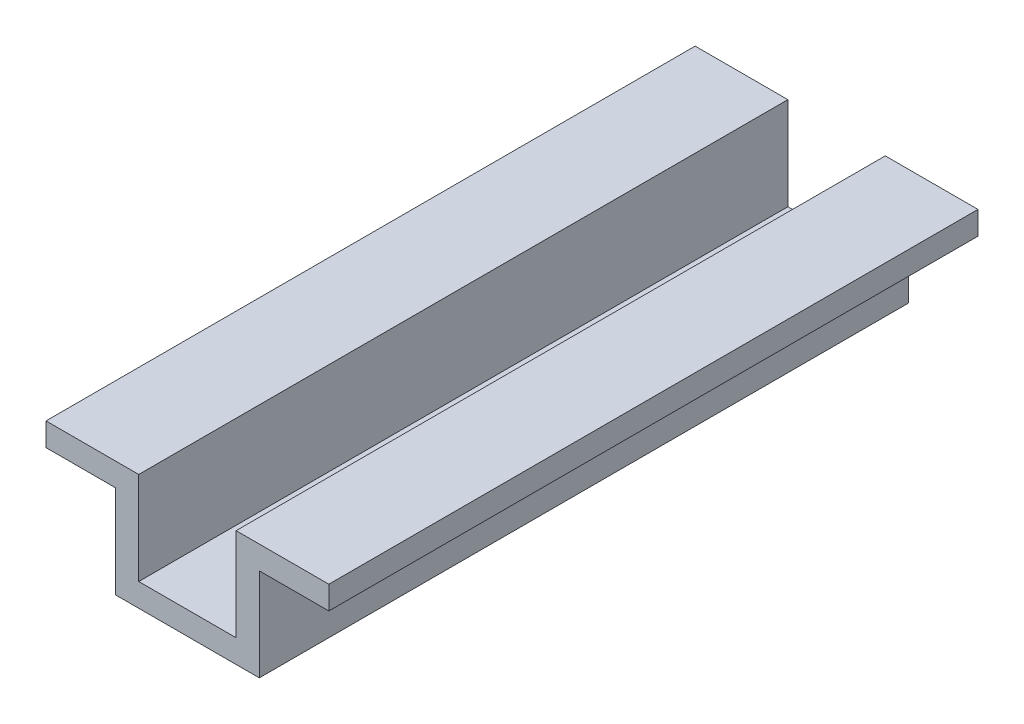
ISO-10303-21;
HEADER;
FILE_DESCRIPTION(('STEP AP214'),'2;1');
FILE_NAME('part.step','',(''),(''),'','','');
FILE_SCHEMA(('AUTOMOTIVE_DESIGN { 1 0 10303 214 1 1 1 1 }'));
ENDSEC;
DATA;
#1=APPLICATION_CONTEXT('core data for automotive mechanical design processes');
#2=APPLICATION_PROTOCOL_DEFINITION('international standard','automotive_design',2000,#1);
#3=PRODUCT_CONTEXT('',#1,'mechanical');
#4=PRODUCT('Part','Part','',(#3));
#5=PRODUCT_RELATED_PRODUCT_CATEGORY('part','',(#4));
#6=PRODUCT_DEFINITION_FORMATION('','',#4);
#7=PRODUCT_DEFINITION_CONTEXT('part definition',#1,'design');
#8=PRODUCT_DEFINITION('design','',#6,#7);
#9=PRODUCT_DEFINITION_SHAPE('','',#8);
#10=(LENGTH_UNIT() NAMED_UNIT(*) SI_UNIT(.MILLI.,.METRE.));
#11=(NAMED_UNIT(*) PLANE_ANGLE_UNIT() SI_UNIT($,.RADIAN.));
#12=(NAMED_UNIT(*) SI_UNIT($,.STERADIAN.) SOLID_ANGLE_UNIT());
#13=UNCERTAINTY_MEASURE_WITH_UNIT(LENGTH_MEASURE(1.E-05),#10,'distance_accuracy_value','');
#14=(GEOMETRIC_REPRESENTATION_CONTEXT(3) GLOBAL_UNCERTAINTY_ASSIGNED_CONTEXT((#13)) GLOBAL_UNIT_ASSIGNED_CONTEXT((#10,
#11,#12)) REPRESENTATION_CONTEXT('',''));
#15=CARTESIAN_POINT('',(0.,0.,0.));
#16=DIRECTION('',(0.,0.,1.));
#17=DIRECTION('',(1.,0.,0.));
#18=AXIS2_PLACEMENT_3D('',#15,#16,#17);
#19=CARTESIAN_POINT('',(0.,20.,140.));
#20=DIRECTION('',(0.,-1.,0.));
#21=DIRECTION('',(0.,0.,-1.));
#22=AXIS2_PLACEMENT_3D('',#19,#20,#21);
#23=PLANE('',#22);
#24=DIRECTION('',(-1.,0.,0.));
#25=VECTOR('',#24,1.);
#26=CARTESIAN_POINT('',(0.,20.,0.));
#27=LINE('',#26,#25);
#28=CARTESIAN_POINT('',(0.,20.,0.));
#29=VERTEX_POINT('',#28);
#30=CARTESIAN_POINT('',(-20.,20.,0.));
#31=VERTEX_POINT('',#30);
#32=EDGE_CURVE('E153',#29,#31,#27,.T.);
#33=ORIENTED_EDGE('',*,*,#32,.T.);
#34=DIRECTION('',(0.,0.,-1.));
#35=VECTOR('',#34,1.);
#36=CARTESIAN_POINT('',(-20.,20.,140.));
#37=LINE('',#36,#35);
#38=CARTESIAN_POINT('',(-20.,20.,140.));
#39=VERTEX_POINT('',#38);
#40=EDGE_CURVE('E11',#39,#31,#37,.T.);
#41=ORIENTED_EDGE('',*,*,#40,.F.);
#42=DIRECTION('',(-1.,0.,0.));
#43=VECTOR('',#42,1.);
#44=CARTESIAN_POINT('',(0.,20.,140.));
#45=LINE('',#44,#43);
#46=CARTESIAN_POINT('',(0.,20.,140.));
#47=VERTEX_POINT('',#46);
#48=EDGE_CURVE('E101',#47,#39,#45,.T.);
#49=ORIENTED_EDGE('',*,*,#48,.F.);
#50=DIRECTION('',(0.,0.,-1.));
#51=VECTOR('',#50,1.);
#52=CARTESIAN_POINT('',(0.,20.,140.));
#53=LINE('',#52,#51);
#54=EDGE_CURVE('E149',#47,#29,#53,.T.);
#55=ORIENTED_EDGE('',*,*,#54,.T.);
#56=EDGE_LOOP('',(#33,#41,#49,#55));
#57=FACE_BOUND('',#56,.T.);
#58=ADVANCED_FACE('F33',(#57),#23,.F.);
#59=CARTESIAN_POINT('',(-20.,15.,140.));
#60=DIRECTION('',(-1.,0.,0.));
#61=DIRECTION('',(0.,0.,1.));
#62=AXIS2_PLACEMENT_3D('',#59,#60,#61);
#63=PLANE('',#62);
#64=DIRECTION('',(0.,1.,0.));
#65=VECTOR('',#64,1.);
#66=CARTESIAN_POINT('',(-20.,15.,0.));
#67=LINE('',#66,#65);
#68=CARTESIAN_POINT('',(-20.,15.,0.));
#69=VERTEX_POINT('',#68);
#70=EDGE_CURVE('E156',#69,#31,#67,.T.);
#71=ORIENTED_EDGE('',*,*,#70,.F.);
#72=DIRECTION('',(0.,0.,-1.));
#73=VECTOR('',#72,1.);
#74=CARTESIAN_POINT('',(-20.,15.,140.));
#75=LINE('',#74,#73);
#76=CARTESIAN_POINT('',(-20.,15.,140.));
#77=VERTEX_POINT('',#76);
#78=EDGE_CURVE('E41',#77,#69,#75,.T.);
#79=ORIENTED_EDGE('',*,*,#78,.F.);
#80=DIRECTION('',(0.,1.,0.));
#81=VECTOR('',#80,1.);
#82=CARTESIAN_POINT('',(-20.,15.,140.));
#83=LINE('',#82,#81);
#84=EDGE_CURVE('E218',#77,#39,#83,.T.);
#85=ORIENTED_EDGE('',*,*,#84,.T.);
#86=ORIENTED_EDGE('',*,*,#40,.T.);
#87=EDGE_LOOP('',(#71,#79,#85,#86));
#88=FACE_BOUND('',#87,.T.);
#89=ADVANCED_FACE('F205',(#88),#63,.T.);
#90=CARTESIAN_POINT('',(0.,15.,140.));
#91=DIRECTION('',(0.,-1.,0.));
#92=DIRECTION('',(0.,0.,-1.));
#93=AXIS2_PLACEMENT_3D('',#90,#91,#92);
#94=PLANE('',#93);
#95=DIRECTION('',(1.,0.,0.));
#96=VECTOR('',#95,1.);
#97=CARTESIAN_POINT('',(0.,15.,0.));
#98=LINE('',#97,#96);
#99=CARTESIAN_POINT('',(-5.,15.,0.));
#100=VERTEX_POINT('',#99);
#101=EDGE_CURVE('E159',#100,#69,#98,.F.);
#102=ORIENTED_EDGE('',*,*,#101,.F.);
#103=DIRECTION('',(0.,0.,-1.));
#104=VECTOR('',#103,1.);
#105=CARTESIAN_POINT('',(-5.,15.,140.));
#106=LINE('',#105,#104);
#107=CARTESIAN_POINT('',(-5.,15.,140.));
#108=VERTEX_POINT('',#107);
#109=EDGE_CURVE('E195',#108,#100,#106,.T.);
#110=ORIENTED_EDGE('',*,*,#109,.F.);
#111=DIRECTION('',(1.,0.,0.));
#112=VECTOR('',#111,1.);
#113=CARTESIAN_POINT('',(0.,15.,140.));
#114=LINE('',#113,#112);
#115=EDGE_CURVE('E202',#108,#77,#114,.F.);
#116=ORIENTED_EDGE('',*,*,#115,.T.);
#117=ORIENTED_EDGE('',*,*,#78,.T.);
#118=EDGE_LOOP('',(#102,#110,#116,#117));
#119=FACE_BOUND('',#118,.T.);
#120=ADVANCED_FACE('F200',(#119),#94,.T.);
#121=CARTESIAN_POINT('',(-5.,0.,140.));
#122=DIRECTION('',(-1.,0.,0.));
#123=DIRECTION('',(0.,0.,1.));
#124=AXIS2_PLACEMENT_3D('',#121,#122,#123);
#125=PLANE('',#124);
#126=DIRECTION('',(0.,1.,0.));
#127=VECTOR('',#126,1.);
#128=CARTESIAN_POINT('',(-5.,0.,0.));
#129=LINE('',#128,#127);
#130=CARTESIAN_POINT('',(-5.,-5.,0.));
#131=VERTEX_POINT('',#130);
#132=EDGE_CURVE('E162',#131,#100,#129,.T.);
#133=ORIENTED_EDGE('',*,*,#132,.F.);
#134=DIRECTION('',(0.,0.,-1.));
#135=VECTOR('',#134,1.);
#136=CARTESIAN_POINT('',(-5.,-5.,140.));
#137=LINE('',#136,#135);
#138=CARTESIAN_POINT('',(-5.,-5.,140.));
#139=VERTEX_POINT('',#138);
#140=EDGE_CURVE('E193',#139,#131,#137,.T.);
#141=ORIENTED_EDGE('',*,*,#140,.F.);
#142=DIRECTION('',(0.,1.,0.));
#143=VECTOR('',#142,1.);
#144=CARTESIAN_POINT('',(-5.,0.,140.));
#145=LINE('',#144,#143);
#146=EDGE_CURVE('E215',#139,#108,#145,.T.);
#147=ORIENTED_EDGE('',*,*,#146,.T.);
#148=ORIENTED_EDGE('',*,*,#109,.T.);
#149=EDGE_LOOP('',(#133,#141,#147,#148));
#150=FACE_BOUND('',#149,.T.);
#151=ADVANCED_FACE('F212',(#150),#125,.T.);
#152=CARTESIAN_POINT('',(0.,-5.,140.));
#153=DIRECTION('',(0.,-1.,0.));
#154=DIRECTION('',(0.,0.,-1.));
#155=AXIS2_PLACEMENT_3D('',#152,#153,#154);
#156=PLANE('',#155);
#157=DIRECTION('',(1.,0.,0.));
#158=VECTOR('',#157,1.);
#159=CARTESIAN_POINT('',(0.,-5.,0.));
#160=LINE('',#159,#158);
#161=CARTESIAN_POINT('',(26.,-5.,0.));
#162=VERTEX_POINT('',#161);
#163=EDGE_CURVE('E165',#162,#131,#160,.F.);
#164=ORIENTED_EDGE('',*,*,#163,.F.);
#165=DIRECTION('',(0.,0.,-1.));
#166=VECTOR('',#165,1.);
#167=CARTESIAN_POINT('',(26.,-5.,140.));
#168=LINE('',#167,#166);
#169=CARTESIAN_POINT('',(26.,-5.,140.));
#170=VERTEX_POINT('',#169);
#171=EDGE_CURVE('E191',#170,#162,#168,.T.);
#172=ORIENTED_EDGE('',*,*,#171,.F.);
#173=DIRECTION('',(1.,0.,0.));
#174=VECTOR('',#173,1.);
#175=CARTESIAN_POINT('',(0.,-5.,140.));
#176=LINE('',#175,#174);
#177=EDGE_CURVE('E220',#170,#139,#176,.F.);
#178=ORIENTED_EDGE('',*,*,#177,.T.);
#179=ORIENTED_EDGE('',*,*,#140,.T.);
#180=EDGE_LOOP('',(#164,#172,#178,#179));
#181=FACE_BOUND('',#180,.T.);
#182=ADVANCED_FACE('F320',(#181),#156,.T.);
#183=CARTESIAN_POINT('',(26.,0.,140.));
#184=DIRECTION('',(1.,0.,0.));
#185=DIRECTION('',(0.,1.,0.));
#186=AXIS2_PLACEMENT_3D('',#183,#184,#185);
#187=PLANE('',#186);
#188=DIRECTION('',(0.,-1.,0.));
#189=VECTOR('',#188,1.);
#190=CARTESIAN_POINT('',(26.,0.,0.));
#191=LINE('',#190,#189);
#192=CARTESIAN_POINT('',(26.,15.,0.));
#193=VERTEX_POINT('',#192);
#194=EDGE_CURVE('E168',#193,#162,#191,.T.);
#195=ORIENTED_EDGE('',*,*,#194,.F.);
#196=DIRECTION('',(0.,0.,-1.));
#197=VECTOR('',#196,1.);
#198=CARTESIAN_POINT('',(26.,15.,140.));
#199=LINE('',#198,#197);
#200=CARTESIAN_POINT('',(26.,15.,140.));
#201=VERTEX_POINT('',#200);
#202=EDGE_CURVE('E189',#201,#193,#199,.T.);
#203=ORIENTED_EDGE('',*,*,#202,.F.);
#204=DIRECTION('',(0.,-1.,0.));
#205=VECTOR('',#204,1.);
#206=CARTESIAN_POINT('',(26.,0.,140.));
#207=LINE('',#206,#205);
#208=EDGE_CURVE('E226',#201,#170,#207,.T.);
#209=ORIENTED_EDGE('',*,*,#208,.T.);
#210=ORIENTED_EDGE('',*,*,#171,.T.);
#211=EDGE_LOOP('',(#195,#203,#209,#210));
#212=FACE_BOUND('',#211,.T.);
#213=ADVANCED_FACE('F311',(#212),#187,.T.);
#214=CARTESIAN_POINT('',(21.,15.,140.));
#215=DIRECTION('',(0.,-1.,0.));
#216=DIRECTION('',(0.,0.,-1.));
#217=AXIS2_PLACEMENT_3D('',#214,#215,#216);
#218=PLANE('',#217);
#219=DIRECTION('',(1.,0.,0.));
#220=VECTOR('',#219,1.);
#221=CARTESIAN_POINT('',(21.,15.,0.));
#222=LINE('',#221,#220);
#223=CARTESIAN_POINT('',(41.,15.,0.));
#224=VERTEX_POINT('',#223);
#225=EDGE_CURVE('E171',#224,#193,#222,.F.);
#226=ORIENTED_EDGE('',*,*,#225,.F.);
#227=DIRECTION('',(0.,0.,-1.));
#228=VECTOR('',#227,1.);
#229=CARTESIAN_POINT('',(41.,15.,140.));
#230=LINE('',#229,#228);
#231=CARTESIAN_POINT('',(41.,15.,140.));
#232=VERTEX_POINT('',#231);
#233=EDGE_CURVE('E187',#232,#224,#230,.T.);
#234=ORIENTED_EDGE('',*,*,#233,.F.);
#235=DIRECTION('',(1.,0.,0.));
#236=VECTOR('',#235,1.);
#237=CARTESIAN_POINT('',(21.,15.,140.));
#238=LINE('',#237,#236);
#239=EDGE_CURVE('E229',#232,#201,#238,.F.);
#240=ORIENTED_EDGE('',*,*,#239,.T.);
#241=ORIENTED_EDGE('',*,*,#202,.T.);
#242=EDGE_LOOP('',(#226,#234,#240,#241));
#243=FACE_BOUND('',#242,.T.);
#244=ADVANCED_FACE('F241',(#243),#218,.T.);
#245=CARTESIAN_POINT('',(41.,20.,140.));
#246=DIRECTION('',(1.,0.,0.));
#247=DIRECTION('',(0.,0.,-1.));
#248=AXIS2_PLACEMENT_3D('',#245,#246,#247);
#249=PLANE('',#248);
#250=DIRECTION('',(0.,-1.,0.));
#251=VECTOR('',#250,1.);
#252=CARTESIAN_POINT('',(41.,20.,0.));
#253=LINE('',#252,#251);
#254=CARTESIAN_POINT('',(41.,20.,0.));
#255=VERTEX_POINT('',#254);
#256=EDGE_CURVE('E174',#255,#224,#253,.T.);
#257=ORIENTED_EDGE('',*,*,#256,.F.);
#258=DIRECTION('',(0.,0.,-1.));
#259=VECTOR('',#258,1.);
#260=CARTESIAN_POINT('',(41.,20.,140.));
#261=LINE('',#260,#259);
#262=CARTESIAN_POINT('',(41.,20.,140.));
#263=VERTEX_POINT('',#262);
#264=EDGE_CURVE('E185',#263,#255,#261,.T.);
#265=ORIENTED_EDGE('',*,*,#264,.F.);
#266=DIRECTION('',(0.,-1.,0.));
#267=VECTOR('',#266,1.);
#268=CARTESIAN_POINT('',(41.,20.,140.));
#269=LINE('',#268,#267);
#270=EDGE_CURVE('E232',#263,#232,#269,.T.);
#271=ORIENTED_EDGE('',*,*,#270,.T.);
#272=ORIENTED_EDGE('',*,*,#233,.T.);
#273=EDGE_LOOP('',(#257,#265,#271,#272));
#274=FACE_BOUND('',#273,.T.);
#275=ADVANCED_FACE('F236',(#274),#249,.T.);
#276=CARTESIAN_POINT('',(21.,20.,140.));
#277=DIRECTION('',(0.,-1.,0.));
#278=DIRECTION('',(0.,0.,-1.));
#279=AXIS2_PLACEMENT_3D('',#276,#277,#278);
#280=PLANE('',#279);
#281=DIRECTION('',(-1.,0.,0.));
#282=VECTOR('',#281,1.);
#283=CARTESIAN_POINT('',(21.,20.,0.));
#284=LINE('',#283,#282);
#285=CARTESIAN_POINT('',(21.,20.,0.));
#286=VERTEX_POINT('',#285);
#287=EDGE_CURVE('E177',#255,#286,#284,.T.);
#288=ORIENTED_EDGE('',*,*,#287,.T.);
#289=DIRECTION('',(0.,0.,-1.));
#290=VECTOR('',#289,1.);
#291=CARTESIAN_POINT('',(21.,20.,140.));
#292=LINE('',#291,#290);
#293=CARTESIAN_POINT('',(21.,20.,140.));
#294=VERTEX_POINT('',#293);
#295=EDGE_CURVE('E144',#294,#286,#292,.T.);
#296=ORIENTED_EDGE('',*,*,#295,.F.);
#297=DIRECTION('',(-1.,0.,0.));
#298=VECTOR('',#297,1.);
#299=CARTESIAN_POINT('',(21.,20.,140.));
#300=LINE('',#299,#298);
#301=EDGE_CURVE('E135',#263,#294,#300,.T.);
#302=ORIENTED_EDGE('',*,*,#301,.F.);
#303=ORIENTED_EDGE('',*,*,#264,.T.);
#304=EDGE_LOOP('',(#288,#296,#302,#303));
#305=FACE_BOUND('',#304,.T.);
#306=ADVANCED_FACE('F245',(#305),#280,.F.);
#307=CARTESIAN_POINT('',(21.,0.,140.));
#308=DIRECTION('',(1.,0.,0.));
#309=DIRECTION('',(0.,1.,0.));
#310=AXIS2_PLACEMENT_3D('',#307,#308,#309);
#311=PLANE('',#310);
#312=DIRECTION('',(0.,-1.,0.));
#313=VECTOR('',#312,1.);
#314=CARTESIAN_POINT('',(21.,0.,0.));
#315=LINE('',#314,#313);
#316=CARTESIAN_POINT('',(21.,0.,0.));
#317=VERTEX_POINT('',#316);
#318=EDGE_CURVE('E143',#286,#317,#315,.T.);
#319=ORIENTED_EDGE('',*,*,#318,.T.);
#320=DIRECTION('',(0.,0.,-1.));
#321=VECTOR('',#320,1.);
#322=CARTESIAN_POINT('',(21.,0.,140.));
#323=LINE('',#322,#321);
#324=CARTESIAN_POINT('',(21.,0.,140.));
#325=VERTEX_POINT('',#324);
#326=EDGE_CURVE('E140',#325,#317,#323,.T.);
#327=ORIENTED_EDGE('',*,*,#326,.F.);
#328=DIRECTION('',(0.,-1.,0.));
#329=VECTOR('',#328,1.);
#330=CARTESIAN_POINT('',(21.,0.,140.));
#331=LINE('',#330,#329);
#332=EDGE_CURVE('E128',#294,#325,#331,.T.);
#333=ORIENTED_EDGE('',*,*,#332,.F.);
#334=ORIENTED_EDGE('',*,*,#295,.T.);
#335=EDGE_LOOP('',(#319,#327,#333,#334));
#336=FACE_BOUND('',#335,.T.);
#337=ADVANCED_FACE('F141',(#336),#311,.F.);
#338=CARTESIAN_POINT('',(0.,0.,140.));
#339=DIRECTION('',(0.,-1.,0.));
#340=DIRECTION('',(0.,0.,-1.));
#341=AXIS2_PLACEMENT_3D('',#338,#339,#340);
#342=PLANE('',#341);
#343=DIRECTION('',(-1.,0.,0.));
#344=VECTOR('',#343,1.);
#345=CARTESIAN_POINT('',(0.,0.,0.));
#346=LINE('',#345,#344);
#347=CARTESIAN_POINT('',(0.,0.,0.));
#348=VERTEX_POINT('',#347);
#349=EDGE_CURVE('E89',#317,#348,#346,.T.);
#350=ORIENTED_EDGE('',*,*,#349,.T.);
#351=DIRECTION('',(0.,0.,-1.));
#352=VECTOR('',#351,1.);
#353=CARTESIAN_POINT('',(0.,0.,140.));
#354=LINE('',#353,#352);
#355=CARTESIAN_POINT('',(0.,0.,140.));
#356=VERTEX_POINT('',#355);
#357=EDGE_CURVE('E145',#356,#348,#354,.T.);
#358=ORIENTED_EDGE('',*,*,#357,.F.);
#359=DIRECTION('',(-1.,0.,0.));
#360=VECTOR('',#359,1.);
#361=CARTESIAN_POINT('',(0.,0.,140.));
#362=LINE('',#361,#360);
#363=EDGE_CURVE('E132',#325,#356,#362,.T.);
#364=ORIENTED_EDGE('',*,*,#363,.F.);
#365=ORIENTED_EDGE('',*,*,#326,.T.);
#366=EDGE_LOOP('',(#350,#358,#364,#365));
#367=FACE_BOUND('',#366,.T.);
#368=ADVANCED_FACE('F147',(#367),#342,.F.);
#369=CARTESIAN_POINT('',(0.,0.,140.));
#370=DIRECTION('',(-1.,0.,0.));
#371=DIRECTION('',(0.,0.,1.));
#372=AXIS2_PLACEMENT_3D('',#369,#370,#371);
#373=PLANE('',#372);
#374=DIRECTION('',(0.,1.,0.));
#375=VECTOR('',#374,1.);
#376=CARTESIAN_POINT('',(0.,0.,0.));
#377=LINE('',#376,#375);
#378=EDGE_CURVE('E95',#348,#29,#377,.T.);
#379=ORIENTED_EDGE('',*,*,#378,.T.);
#380=ORIENTED_EDGE('',*,*,#54,.F.);
#381=DIRECTION('',(0.,1.,0.));
#382=VECTOR('',#381,1.);
#383=CARTESIAN_POINT('',(0.,0.,140.));
#384=LINE('',#383,#382);
#385=EDGE_CURVE('E49',#356,#47,#384,.T.);
#386=ORIENTED_EDGE('',*,*,#385,.F.);
#387=ORIENTED_EDGE('',*,*,#357,.T.);
#388=EDGE_LOOP('',(#379,#380,#386,#387));
#389=FACE_BOUND('',#388,.T.);
#390=ADVANCED_FACE('F259',(#389),#373,.F.);
#391=CARTESIAN_POINT('',(0.,0.,140.));
#392=DIRECTION('',(0.,0.,-1.));
#393=DIRECTION('',(-1.,0.,0.));
#394=AXIS2_PLACEMENT_3D('',#391,#392,#393);
#395=PLANE('',#394);
#396=ORIENTED_EDGE('',*,*,#48,.T.);
#397=ORIENTED_EDGE('',*,*,#84,.F.);
#398=ORIENTED_EDGE('',*,*,#115,.F.);
#399=ORIENTED_EDGE('',*,*,#146,.F.);
#400=ORIENTED_EDGE('',*,*,#177,.F.);
#401=ORIENTED_EDGE('',*,*,#208,.F.);
#402=ORIENTED_EDGE('',*,*,#239,.F.);
#403=ORIENTED_EDGE('',*,*,#270,.F.);
#404=ORIENTED_EDGE('',*,*,#301,.T.);
#405=ORIENTED_EDGE('',*,*,#332,.T.);
#406=ORIENTED_EDGE('',*,*,#363,.T.);
#407=ORIENTED_EDGE('',*,*,#385,.T.);
#408=EDGE_LOOP('',(#396,#397,#398,#399,#400,#401,#402,#403,#404,#405,#406,#407));
#409=FACE_BOUND('',#408,.T.);
#410=ADVANCED_FACE('F130',(#409),#395,.F.);
#411=CARTESIAN_POINT('',(0.,0.,0.));
#412=DIRECTION('',(0.,0.,-1.));
#413=DIRECTION('',(-1.,0.,0.));
#414=AXIS2_PLACEMENT_3D('',#411,#412,#413);
#415=PLANE('',#414);
#416=ORIENTED_EDGE('',*,*,#32,.F.);
#417=ORIENTED_EDGE('',*,*,#378,.F.);
#418=ORIENTED_EDGE('',*,*,#349,.F.);
#419=ORIENTED_EDGE('',*,*,#318,.F.);
#420=ORIENTED_EDGE('',*,*,#287,.F.);
#421=ORIENTED_EDGE('',*,*,#256,.T.);
#422=ORIENTED_EDGE('',*,*,#225,.T.);
#423=ORIENTED_EDGE('',*,*,#194,.T.);
#424=ORIENTED_EDGE('',*,*,#163,.T.);
#425=ORIENTED_EDGE('',*,*,#132,.T.);
#426=ORIENTED_EDGE('',*,*,#101,.T.);
#427=ORIENTED_EDGE('',*,*,#70,.T.);
#428=EDGE_LOOP('',(#416,#417,#418,#419,#420,#421,#422,#423,#424,#425,#426,#427));
#429=FACE_BOUND('',#428,.T.);
#430=ADVANCED_FACE('F208',(#429),#415,.T.);
#431=CLOSED_SHELL('',(#58,#89,#120,#151,#182,#213,#244,#275,#306,#337,#368,#390,#410,#430));
#432=MANIFOLD_SOLID_BREP('B2',#431);
#433=ADVANCED_BREP_SHAPE_REPRESENTATION('',(#18,#432),#14);
#434=SHAPE_DEFINITION_REPRESENTATION(#9,#433);
ENDSEC;
END-ISO-10303-21;
